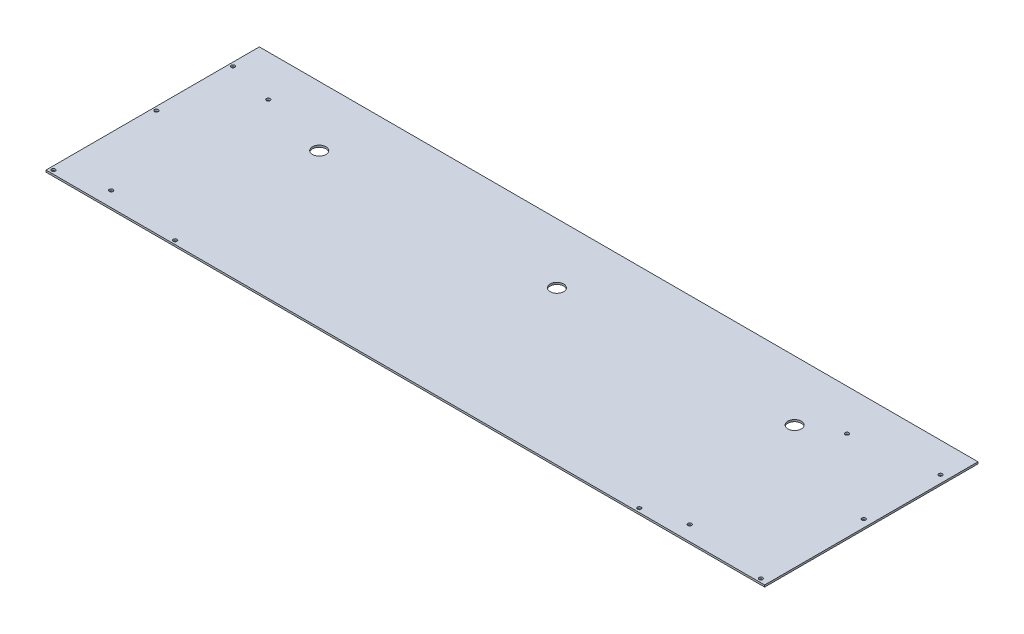
ISO-10303-21;
HEADER;
FILE_DESCRIPTION(('STEP AP214'),'2;1');
FILE_NAME('part.step','',(''),(''),'','','');
FILE_SCHEMA(('AUTOMOTIVE_DESIGN { 1 0 10303 214 1 1 1 1 }'));
ENDSEC;
DATA;
#1=APPLICATION_CONTEXT('core data for automotive mechanical design processes');
#2=APPLICATION_PROTOCOL_DEFINITION('international standard','automotive_design',2000,#1);
#3=PRODUCT_CONTEXT('',#1,'mechanical');
#4=PRODUCT('Part','Part','',(#3));
#5=PRODUCT_RELATED_PRODUCT_CATEGORY('part','',(#4));
#6=PRODUCT_DEFINITION_FORMATION('','',#4);
#7=PRODUCT_DEFINITION_CONTEXT('part definition',#1,'design');
#8=PRODUCT_DEFINITION('design','',#6,#7);
#9=PRODUCT_DEFINITION_SHAPE('','',#8);
#10=(LENGTH_UNIT() NAMED_UNIT(*) SI_UNIT(.MILLI.,.METRE.));
#11=(NAMED_UNIT(*) PLANE_ANGLE_UNIT() SI_UNIT($,.RADIAN.));
#12=(NAMED_UNIT(*) SI_UNIT($,.STERADIAN.) SOLID_ANGLE_UNIT());
#13=UNCERTAINTY_MEASURE_WITH_UNIT(LENGTH_MEASURE(1.E-05),#10,'distance_accuracy_value','');
#14=(GEOMETRIC_REPRESENTATION_CONTEXT(3) GLOBAL_UNCERTAINTY_ASSIGNED_CONTEXT((#13)) GLOBAL_UNIT_ASSIGNED_CONTEXT((#10,
#11,#12)) REPRESENTATION_CONTEXT('',''));
#15=CARTESIAN_POINT('',(0.,0.,0.));
#16=DIRECTION('',(0.,0.,1.));
#17=DIRECTION('',(1.,0.,0.));
#18=AXIS2_PLACEMENT_3D('',#15,#16,#17);
#19=CARTESIAN_POINT('',(1.58750000000008,-22.225,1612.9));
#20=DIRECTION('',(0.,-1.,0.));
#21=DIRECTION('',(0.,0.,-1.));
#22=AXIS2_PLACEMENT_3D('',#19,#20,#21);
#23=PLANE('',#22);
#24=CARTESIAN_POINT('',(600.075,-22.2249999999998,1482.78991037368));
#25=DIRECTION('',(0.,1.,0.));
#26=DIRECTION('',(0.,0.,1.));
#27=AXIS2_PLACEMENT_3D('',#24,#25,#26);
#28=CIRCLE('',#27,3.175);
#29=CARTESIAN_POINT('',(600.075,-22.2249999999998,1485.96491037368));
#30=VERTEX_POINT('',#29);
#31=EDGE_CURVE('E128',#30,#30,#28,.T.);
#32=ORIENTED_EDGE('',*,*,#31,.T.);
#33=EDGE_LOOP('',(#32));
#34=FACE_BOUND('',#33,.T.);
#35=CARTESIAN_POINT('',(393.7,-22.2249999999997,1787.525));
#36=DIRECTION('',(0.,1.,0.));
#37=DIRECTION('',(0.,0.,1.));
#38=AXIS2_PLACEMENT_3D('',#35,#36,#37);
#39=CIRCLE('',#38,3.175);
#40=CARTESIAN_POINT('',(393.7,-22.2249999999997,1790.7));
#41=VERTEX_POINT('',#40);
#42=EDGE_CURVE('E138',#41,#41,#39,.T.);
#43=ORIENTED_EDGE('',*,*,#42,.T.);
#44=EDGE_LOOP('',(#43));
#45=FACE_BOUND('',#44,.T.);
#46=CARTESIAN_POINT('',(-393.7,-22.225,1787.525));
#47=DIRECTION('',(0.,1.,0.));
#48=DIRECTION('',(0.,0.,1.));
#49=AXIS2_PLACEMENT_3D('',#46,#47,#48);
#50=CIRCLE('',#49,3.175);
#51=CARTESIAN_POINT('',(-393.7,-22.225,1790.7));
#52=VERTEX_POINT('',#51);
#53=EDGE_CURVE('E369',#52,#52,#50,.T.);
#54=ORIENTED_EDGE('',*,*,#53,.T.);
#55=EDGE_LOOP('',(#54));
#56=FACE_BOUND('',#55,.T.);
#57=CARTESIAN_POINT('',(403.225,-22.225,1533.525));
#58=DIRECTION('',(0.,1.,0.));
#59=DIRECTION('',(0.,0.,1.));
#60=AXIS2_PLACEMENT_3D('',#57,#58,#59);
#61=CIRCLE('',#60,11.43);
#62=CARTESIAN_POINT('',(403.225,-22.225,1544.955));
#63=VERTEX_POINT('',#62);
#64=EDGE_CURVE('E382',#63,#63,#61,.T.);
#65=ORIENTED_EDGE('',*,*,#64,.T.);
#66=EDGE_LOOP('',(#65));
#67=FACE_BOUND('',#66,.T.);
#68=DIRECTION('',(-1.,0.,0.));
#69=VECTOR('',#68,1.);
#70=CARTESIAN_POINT('',(1.58749999999981,-22.2249999999997,1793.875));
#71=LINE('',#70,#69);
#72=CARTESIAN_POINT('',(612.775,-22.2249999999999,1793.875));
#73=VERTEX_POINT('',#72);
#74=CARTESIAN_POINT('',(-606.425,-22.225,1793.875));
#75=VERTEX_POINT('',#74);
#76=EDGE_CURVE('E120',#73,#75,#71,.T.);
#77=ORIENTED_EDGE('',*,*,#76,.T.);
#78=DIRECTION('',(0.,0.,1.));
#79=VECTOR('',#78,1.);
#80=CARTESIAN_POINT('',(-606.425,-22.225,1613.48881511688));
#81=LINE('',#80,#79);
#82=CARTESIAN_POINT('',(-606.425,-22.225,1432.00160884857));
#83=VERTEX_POINT('',#82);
#84=EDGE_CURVE('E118',#83,#75,#81,.T.);
#85=ORIENTED_EDGE('',*,*,#84,.F.);
#86=DIRECTION('',(0.999998277526344,0.,-0.00185605612635899));
#87=VECTOR('',#86,1.);
#88=CARTESIAN_POINT('',(-585.7875,-22.225,1431.96330442429));
#89=LINE('',#88,#87);
#90=CARTESIAN_POINT('',(-565.149999998547,-22.225,1431.925));
#91=VERTEX_POINT('',#90);
#92=EDGE_CURVE('E69',#83,#91,#89,.T.);
#93=ORIENTED_EDGE('',*,*,#92,.T.);
#94=DIRECTION('',(1.,0.,0.));
#95=VECTOR('',#94,1.);
#96=CARTESIAN_POINT('',(0.,-22.225,1431.925));
#97=LINE('',#96,#95);
#98=CARTESIAN_POINT('',(612.775,-22.225,1431.925));
#99=VERTEX_POINT('',#98);
#100=EDGE_CURVE('E67',#99,#91,#97,.F.);
#101=ORIENTED_EDGE('',*,*,#100,.F.);
#102=DIRECTION('',(0.,0.,1.));
#103=VECTOR('',#102,1.);
#104=CARTESIAN_POINT('',(612.775,-22.225,1612.9));
#105=LINE('',#104,#103);
#106=EDGE_CURVE('E64',#99,#73,#105,.T.);
#107=ORIENTED_EDGE('',*,*,#106,.T.);
#108=EDGE_LOOP('',(#77,#85,#93,#101,#107));
#109=FACE_BOUND('',#108,.T.);
#110=CARTESIAN_POINT('',(-403.225,-22.225,1533.525));
#111=DIRECTION('',(0.,1.,0.));
#112=DIRECTION('',(0.,0.,1.));
#113=AXIS2_PLACEMENT_3D('',#110,#111,#112);
#114=CIRCLE('',#113,11.43);
#115=CARTESIAN_POINT('',(-403.225,-22.225,1544.955));
#116=VERTEX_POINT('',#115);
#117=EDGE_CURVE('E112',#116,#116,#114,.T.);
#118=ORIENTED_EDGE('',*,*,#117,.T.);
#119=EDGE_LOOP('',(#118));
#120=FACE_BOUND('',#119,.T.);
#121=CARTESIAN_POINT('',(0.,-22.225,1533.525));
#122=DIRECTION('',(0.,1.,0.));
#123=DIRECTION('',(0.,0.,1.));
#124=AXIS2_PLACEMENT_3D('',#121,#122,#123);
#125=CIRCLE('',#124,11.43);
#126=CARTESIAN_POINT('',(0.,-22.225,1544.955));
#127=VERTEX_POINT('',#126);
#128=EDGE_CURVE('E387',#127,#127,#125,.T.);
#129=ORIENTED_EDGE('',*,*,#128,.T.);
#130=EDGE_LOOP('',(#129));
#131=FACE_BOUND('',#130,.T.);
#132=CARTESIAN_POINT('',(-600.075,-22.225,1787.525));
#133=DIRECTION('',(0.,1.,0.));
#134=DIRECTION('',(0.,0.,1.));
#135=AXIS2_PLACEMENT_3D('',#132,#133,#134);
#136=CIRCLE('',#135,3.175);
#137=CARTESIAN_POINT('',(-600.075,-22.225,1790.7));
#138=VERTEX_POINT('',#137);
#139=EDGE_CURVE('E75',#138,#138,#136,.T.);
#140=ORIENTED_EDGE('',*,*,#139,.T.);
#141=EDGE_LOOP('',(#140));
#142=FACE_BOUND('',#141,.T.);
#143=CARTESIAN_POINT('',(600.075,-22.2249999999998,1612.93830442429));
#144=DIRECTION('',(0.,1.,0.));
#145=DIRECTION('',(0.,0.,1.));
#146=AXIS2_PLACEMENT_3D('',#143,#144,#145);
#147=CIRCLE('',#146,3.175);
#148=CARTESIAN_POINT('',(600.075,-22.2249999999998,1616.11330442429));
#149=VERTEX_POINT('',#148);
#150=EDGE_CURVE('E386',#149,#149,#147,.T.);
#151=ORIENTED_EDGE('',*,*,#150,.T.);
#152=EDGE_LOOP('',(#151));
#153=FACE_BOUND('',#152,.T.);
#154=CARTESIAN_POINT('',(-600.075,-22.225,1482.78991037368));
#155=DIRECTION('',(0.,1.,0.));
#156=DIRECTION('',(0.,0.,1.));
#157=AXIS2_PLACEMENT_3D('',#154,#155,#156);
#158=CIRCLE('',#157,3.175);
#159=CARTESIAN_POINT('',(-600.075,-22.225,1485.96491037368));
#160=VERTEX_POINT('',#159);
#161=EDGE_CURVE('E153',#160,#160,#158,.T.);
#162=ORIENTED_EDGE('',*,*,#161,.T.);
#163=EDGE_LOOP('',(#162));
#164=FACE_BOUND('',#163,.T.);
#165=CARTESIAN_POINT('',(600.075,-22.2249999999997,1787.525));
#166=DIRECTION('',(0.,1.,0.));
#167=DIRECTION('',(0.,0.,1.));
#168=AXIS2_PLACEMENT_3D('',#165,#166,#167);
#169=CIRCLE('',#168,3.175);
#170=CARTESIAN_POINT('',(600.075,-22.2249999999997,1790.7));
#171=VERTEX_POINT('',#170);
#172=EDGE_CURVE('E133',#171,#171,#169,.T.);
#173=ORIENTED_EDGE('',*,*,#172,.T.);
#174=EDGE_LOOP('',(#173));
#175=FACE_BOUND('',#174,.T.);
#176=CARTESIAN_POINT('',(-600.075,-22.225,1612.93830442429));
#177=DIRECTION('',(0.,1.,0.));
#178=DIRECTION('',(0.,0.,1.));
#179=AXIS2_PLACEMENT_3D('',#176,#177,#178);
#180=CIRCLE('',#179,3.175);
#181=CARTESIAN_POINT('',(-600.075,-22.225,1616.11330442429));
#182=VERTEX_POINT('',#181);
#183=EDGE_CURVE('E150',#182,#182,#180,.T.);
#184=ORIENTED_EDGE('',*,*,#183,.T.);
#185=EDGE_LOOP('',(#184));
#186=FACE_BOUND('',#185,.T.);
#187=CARTESIAN_POINT('',(-521.299365329742,-22.225,1501.775));
#188=DIRECTION('',(0.,1.,0.));
#189=DIRECTION('',(0.,0.,1.));
#190=AXIS2_PLACEMENT_3D('',#187,#188,#189);
#191=CIRCLE('',#190,3.175);
#192=CARTESIAN_POINT('',(-521.299365329742,-22.225,1504.95));
#193=VERTEX_POINT('',#192);
#194=EDGE_CURVE('E154',#193,#193,#191,.T.);
#195=ORIENTED_EDGE('',*,*,#194,.T.);
#196=EDGE_LOOP('',(#195));
#197=FACE_BOUND('',#196,.T.);
#198=CARTESIAN_POINT('',(460.375,-22.2249999999997,1768.475));
#199=DIRECTION('',(0.,1.,0.));
#200=DIRECTION('',(0.,0.,1.));
#201=AXIS2_PLACEMENT_3D('',#198,#199,#200);
#202=CIRCLE('',#201,3.175);
#203=CARTESIAN_POINT('',(460.375,-22.2249999999997,1771.65));
#204=VERTEX_POINT('',#203);
#205=EDGE_CURVE('E160',#204,#204,#202,.T.);
#206=ORIENTED_EDGE('',*,*,#205,.T.);
#207=EDGE_LOOP('',(#206));
#208=FACE_BOUND('',#207,.T.);
#209=CARTESIAN_POINT('',(-521.299365329743,-22.225,1768.475));
#210=DIRECTION('',(0.,1.,0.));
#211=DIRECTION('',(0.,0.,1.));
#212=AXIS2_PLACEMENT_3D('',#209,#210,#211);
#213=CIRCLE('',#212,3.175);
#214=CARTESIAN_POINT('',(-521.299365329743,-22.225,1771.65));
#215=VERTEX_POINT('',#214);
#216=EDGE_CURVE('E163',#215,#215,#213,.T.);
#217=ORIENTED_EDGE('',*,*,#216,.T.);
#218=EDGE_LOOP('',(#217));
#219=FACE_BOUND('',#218,.T.);
#220=CARTESIAN_POINT('',(460.375,-22.225,1501.775));
#221=DIRECTION('',(0.,1.,0.));
#222=DIRECTION('',(0.,0.,1.));
#223=AXIS2_PLACEMENT_3D('',#220,#221,#222);
#224=CIRCLE('',#223,3.175);
#225=CARTESIAN_POINT('',(460.375,-22.225,1504.95));
#226=VERTEX_POINT('',#225);
#227=EDGE_CURVE('E20',#226,#226,#224,.T.);
#228=ORIENTED_EDGE('',*,*,#227,.T.);
#229=EDGE_LOOP('',(#228));
#230=FACE_BOUND('',#229,.T.);
#231=ADVANCED_FACE('F17',(#34,#45,#56,#67,#109,#120,#131,#142,#153,#164,#175,#186,#197,#208,
#219,#230),#23,.T.);
#232=CARTESIAN_POINT('',(460.375,3.17500000000021,1501.775));
#233=DIRECTION('',(0.,1.,0.));
#234=DIRECTION('',(0.,0.,1.));
#235=AXIS2_PLACEMENT_3D('',#232,#233,#234);
#236=CYLINDRICAL_SURFACE('',#235,3.175);
#237=CARTESIAN_POINT('',(460.375,-19.05,1501.775));
#238=DIRECTION('',(0.,1.,0.));
#239=DIRECTION('',(0.,0.,1.));
#240=AXIS2_PLACEMENT_3D('',#237,#238,#239);
#241=CIRCLE('',#240,3.175);
#242=CARTESIAN_POINT('',(460.375,-19.05,1504.95));
#243=VERTEX_POINT('',#242);
#244=EDGE_CURVE('E132',#243,#243,#241,.T.);
#245=ORIENTED_EDGE('',*,*,#244,.T.);
#246=EDGE_LOOP('',(#245));
#247=FACE_BOUND('',#246,.T.);
#248=ORIENTED_EDGE('',*,*,#227,.F.);
#249=EDGE_LOOP('',(#248));
#250=FACE_BOUND('',#249,.T.);
#251=ADVANCED_FACE('F173',(#247,#250),#236,.F.);
#252=CARTESIAN_POINT('',(-521.299365329743,3.17500000000011,1768.475));
#253=DIRECTION('',(0.,1.,0.));
#254=DIRECTION('',(0.,0.,1.));
#255=AXIS2_PLACEMENT_3D('',#252,#253,#254);
#256=CYLINDRICAL_SURFACE('',#255,3.175);
#257=CARTESIAN_POINT('',(-521.299365329743,-19.05,1768.475));
#258=DIRECTION('',(0.,1.,0.));
#259=DIRECTION('',(0.,0.,1.));
#260=AXIS2_PLACEMENT_3D('',#257,#258,#259);
#261=CIRCLE('',#260,3.175);
#262=CARTESIAN_POINT('',(-521.299365329743,-19.05,1771.65));
#263=VERTEX_POINT('',#262);
#264=EDGE_CURVE('E271',#263,#263,#261,.T.);
#265=ORIENTED_EDGE('',*,*,#264,.T.);
#266=EDGE_LOOP('',(#265));
#267=FACE_BOUND('',#266,.T.);
#268=ORIENTED_EDGE('',*,*,#216,.F.);
#269=EDGE_LOOP('',(#268));
#270=FACE_BOUND('',#269,.T.);
#271=ADVANCED_FACE('F175',(#267,#270),#256,.F.);
#272=CARTESIAN_POINT('',(460.375,3.17500000000029,1768.475));
#273=DIRECTION('',(0.,1.,0.));
#274=DIRECTION('',(0.,0.,1.));
#275=AXIS2_PLACEMENT_3D('',#272,#273,#274);
#276=CYLINDRICAL_SURFACE('',#275,3.175);
#277=CARTESIAN_POINT('',(460.375,-19.0499999999997,1768.475));
#278=DIRECTION('',(0.,1.,0.));
#279=DIRECTION('',(0.,0.,1.));
#280=AXIS2_PLACEMENT_3D('',#277,#278,#279);
#281=CIRCLE('',#280,3.175);
#282=CARTESIAN_POINT('',(460.375,-19.0499999999997,1771.65));
#283=VERTEX_POINT('',#282);
#284=EDGE_CURVE('E266',#283,#283,#281,.T.);
#285=ORIENTED_EDGE('',*,*,#284,.T.);
#286=EDGE_LOOP('',(#285));
#287=FACE_BOUND('',#286,.T.);
#288=ORIENTED_EDGE('',*,*,#205,.F.);
#289=EDGE_LOOP('',(#288));
#290=FACE_BOUND('',#289,.T.);
#291=ADVANCED_FACE('F182',(#287,#290),#276,.F.);
#292=CARTESIAN_POINT('',(-521.299365329742,3.175,1501.775));
#293=DIRECTION('',(0.,1.,0.));
#294=DIRECTION('',(0.,0.,1.));
#295=AXIS2_PLACEMENT_3D('',#292,#293,#294);
#296=CYLINDRICAL_SURFACE('',#295,3.175);
#297=CARTESIAN_POINT('',(-521.299365329742,-19.05,1501.775));
#298=DIRECTION('',(0.,1.,0.));
#299=DIRECTION('',(0.,0.,1.));
#300=AXIS2_PLACEMENT_3D('',#297,#298,#299);
#301=CIRCLE('',#300,3.175);
#302=CARTESIAN_POINT('',(-521.299365329742,-19.05,1504.95));
#303=VERTEX_POINT('',#302);
#304=EDGE_CURVE('E270',#303,#303,#301,.T.);
#305=ORIENTED_EDGE('',*,*,#304,.T.);
#306=EDGE_LOOP('',(#305));
#307=FACE_BOUND('',#306,.T.);
#308=ORIENTED_EDGE('',*,*,#194,.F.);
#309=EDGE_LOOP('',(#308));
#310=FACE_BOUND('',#309,.T.);
#311=ADVANCED_FACE('F254',(#307,#310),#296,.F.);
#312=CARTESIAN_POINT('',(-600.075,-15.875,1612.93830442429));
#313=DIRECTION('',(0.,1.,0.));
#314=DIRECTION('',(0.,0.,1.));
#315=AXIS2_PLACEMENT_3D('',#312,#313,#314);
#316=CYLINDRICAL_SURFACE('',#315,3.175);
#317=CARTESIAN_POINT('',(-600.075,-19.05,1612.93830442429));
#318=DIRECTION('',(0.,1.,0.));
#319=DIRECTION('',(0.,0.,1.));
#320=AXIS2_PLACEMENT_3D('',#317,#318,#319);
#321=CIRCLE('',#320,3.175);
#322=CARTESIAN_POINT('',(-600.075,-19.05,1616.11330442429));
#323=VERTEX_POINT('',#322);
#324=EDGE_CURVE('E274',#323,#323,#321,.T.);
#325=ORIENTED_EDGE('',*,*,#324,.T.);
#326=EDGE_LOOP('',(#325));
#327=FACE_BOUND('',#326,.T.);
#328=ORIENTED_EDGE('',*,*,#183,.F.);
#329=EDGE_LOOP('',(#328));
#330=FACE_BOUND('',#329,.T.);
#331=ADVANCED_FACE('F250',(#327,#330),#316,.F.);
#332=CARTESIAN_POINT('',(-600.075,-15.875,1482.78991037368));
#333=DIRECTION('',(0.,1.,0.));
#334=DIRECTION('',(0.,0.,1.));
#335=AXIS2_PLACEMENT_3D('',#332,#333,#334);
#336=CYLINDRICAL_SURFACE('',#335,3.175);
#337=CARTESIAN_POINT('',(-600.075,-19.05,1482.78991037368));
#338=DIRECTION('',(0.,1.,0.));
#339=DIRECTION('',(0.,0.,1.));
#340=AXIS2_PLACEMENT_3D('',#337,#338,#339);
#341=CIRCLE('',#340,3.175);
#342=CARTESIAN_POINT('',(-600.075,-19.05,1485.96491037368));
#343=VERTEX_POINT('',#342);
#344=EDGE_CURVE('E289',#343,#343,#341,.T.);
#345=ORIENTED_EDGE('',*,*,#344,.T.);
#346=EDGE_LOOP('',(#345));
#347=FACE_BOUND('',#346,.T.);
#348=ORIENTED_EDGE('',*,*,#161,.F.);
#349=EDGE_LOOP('',(#348));
#350=FACE_BOUND('',#349,.T.);
#351=ADVANCED_FACE('F246',(#347,#350),#336,.F.);
#352=CARTESIAN_POINT('',(-393.7,-15.875,1787.525));
#353=DIRECTION('',(0.,1.,0.));
#354=DIRECTION('',(0.,0.,1.));
#355=AXIS2_PLACEMENT_3D('',#352,#353,#354);
#356=CYLINDRICAL_SURFACE('',#355,3.175);
#357=CARTESIAN_POINT('',(-393.7,-19.05,1787.525));
#358=DIRECTION('',(0.,1.,0.));
#359=DIRECTION('',(0.,0.,1.));
#360=AXIS2_PLACEMENT_3D('',#357,#358,#359);
#361=CIRCLE('',#360,3.175);
#362=CARTESIAN_POINT('',(-393.7,-19.05,1790.7));
#363=VERTEX_POINT('',#362);
#364=EDGE_CURVE('E293',#363,#363,#361,.T.);
#365=ORIENTED_EDGE('',*,*,#364,.T.);
#366=EDGE_LOOP('',(#365));
#367=FACE_BOUND('',#366,.T.);
#368=ORIENTED_EDGE('',*,*,#53,.F.);
#369=EDGE_LOOP('',(#368));
#370=FACE_BOUND('',#369,.T.);
#371=ADVANCED_FACE('F242',(#367,#370),#356,.F.);
#372=CARTESIAN_POINT('',(-600.075,-15.875,1787.525));
#373=DIRECTION('',(0.,1.,0.));
#374=DIRECTION('',(0.,0.,1.));
#375=AXIS2_PLACEMENT_3D('',#372,#373,#374);
#376=CYLINDRICAL_SURFACE('',#375,3.175);
#377=CARTESIAN_POINT('',(-600.075,-19.05,1787.525));
#378=DIRECTION('',(0.,1.,0.));
#379=DIRECTION('',(0.,0.,1.));
#380=AXIS2_PLACEMENT_3D('',#377,#378,#379);
#381=CIRCLE('',#380,3.175);
#382=CARTESIAN_POINT('',(-600.075,-19.05,1790.7));
#383=VERTEX_POINT('',#382);
#384=EDGE_CURVE('E110',#383,#383,#381,.T.);
#385=ORIENTED_EDGE('',*,*,#384,.T.);
#386=EDGE_LOOP('',(#385));
#387=FACE_BOUND('',#386,.T.);
#388=ORIENTED_EDGE('',*,*,#139,.F.);
#389=EDGE_LOOP('',(#388));
#390=FACE_BOUND('',#389,.T.);
#391=ADVANCED_FACE('F239',(#387,#390),#376,.F.);
#392=CARTESIAN_POINT('',(0.,-19.05,1431.925));
#393=DIRECTION('',(0.,0.,-1.));
#394=DIRECTION('',(0.,1.,0.));
#395=AXIS2_PLACEMENT_3D('',#392,#393,#394);
#396=PLANE('',#395);
#397=DIRECTION('',(1.,0.,0.));
#398=VECTOR('',#397,1.);
#399=CARTESIAN_POINT('',(1.58750000000008,-19.0500000000001,1431.925));
#400=LINE('',#399,#398);
#401=CARTESIAN_POINT('',(-565.149999989423,-19.05,1431.92499999999));
#402=VERTEX_POINT('',#401);
#403=CARTESIAN_POINT('',(612.775,-19.0499999999999,1431.925));
#404=VERTEX_POINT('',#403);
#405=EDGE_CURVE('E86',#402,#404,#400,.T.);
#406=ORIENTED_EDGE('',*,*,#405,.T.);
#407=DIRECTION('',(0.,-1.,0.));
#408=VECTOR('',#407,1.);
#409=CARTESIAN_POINT('',(612.775,-19.0499999999998,1431.925));
#410=LINE('',#409,#408);
#411=EDGE_CURVE('E74',#404,#99,#410,.T.);
#412=ORIENTED_EDGE('',*,*,#411,.T.);
#413=ORIENTED_EDGE('',*,*,#100,.T.);
#414=DIRECTION('',(0.,1.,0.));
#415=VECTOR('',#414,1.);
#416=CARTESIAN_POINT('',(-565.15,-19.05,1431.925));
#417=LINE('',#416,#415);
#418=EDGE_CURVE('E114',#91,#402,#417,.T.);
#419=ORIENTED_EDGE('',*,*,#418,.T.);
#420=EDGE_LOOP('',(#406,#412,#413,#419));
#421=FACE_BOUND('',#420,.T.);
#422=ADVANCED_FACE('F85',(#421),#396,.T.);
#423=CARTESIAN_POINT('',(612.775,-19.0499999999998,1612.9));
#424=DIRECTION('',(-1.,0.,0.));
#425=DIRECTION('',(0.,-1.,0.));
#426=AXIS2_PLACEMENT_3D('',#423,#424,#425);
#427=PLANE('',#426);
#428=ORIENTED_EDGE('',*,*,#411,.F.);
#429=DIRECTION('',(0.,0.,-1.));
#430=VECTOR('',#429,1.);
#431=CARTESIAN_POINT('',(612.775,-19.0499999999999,1612.9));
#432=LINE('',#431,#430);
#433=CARTESIAN_POINT('',(612.775,-19.0499999999998,1793.875));
#434=VERTEX_POINT('',#433);
#435=EDGE_CURVE('E107',#404,#434,#432,.F.);
#436=ORIENTED_EDGE('',*,*,#435,.T.);
#437=DIRECTION('',(0.,1.,0.));
#438=VECTOR('',#437,1.);
#439=CARTESIAN_POINT('',(612.775,-19.05,1793.875));
#440=LINE('',#439,#438);
#441=EDGE_CURVE('E82',#434,#73,#440,.F.);
#442=ORIENTED_EDGE('',*,*,#441,.T.);
#443=ORIENTED_EDGE('',*,*,#106,.F.);
#444=EDGE_LOOP('',(#428,#436,#442,#443));
#445=FACE_BOUND('',#444,.T.);
#446=ADVANCED_FACE('F79',(#445),#427,.F.);
#447=CARTESIAN_POINT('',(1.58749999999981,-19.05,1793.875));
#448=DIRECTION('',(0.,0.,-1.));
#449=DIRECTION('',(-1.,0.,0.));
#450=AXIS2_PLACEMENT_3D('',#447,#448,#449);
#451=PLANE('',#450);
#452=ORIENTED_EDGE('',*,*,#441,.F.);
#453=DIRECTION('',(1.,0.,0.));
#454=VECTOR('',#453,1.);
#455=CARTESIAN_POINT('',(1.58750000000008,-19.0499999999999,1793.875));
#456=LINE('',#455,#454);
#457=CARTESIAN_POINT('',(-606.425,-19.05,1793.875));
#458=VERTEX_POINT('',#457);
#459=EDGE_CURVE('E104',#434,#458,#456,.F.);
#460=ORIENTED_EDGE('',*,*,#459,.T.);
#461=DIRECTION('',(0.,-1.,0.));
#462=VECTOR('',#461,1.);
#463=CARTESIAN_POINT('',(-606.425,-19.05,1793.875));
#464=LINE('',#463,#462);
#465=EDGE_CURVE('E116',#75,#458,#464,.F.);
#466=ORIENTED_EDGE('',*,*,#465,.F.);
#467=ORIENTED_EDGE('',*,*,#76,.F.);
#468=EDGE_LOOP('',(#452,#460,#466,#467));
#469=FACE_BOUND('',#468,.T.);
#470=ADVANCED_FACE('F230',(#469),#451,.F.);
#471=CARTESIAN_POINT('',(-606.425,-19.05,1613.48881511688));
#472=DIRECTION('',(-1.,0.,0.));
#473=DIRECTION('',(0.,-1.,0.));
#474=AXIS2_PLACEMENT_3D('',#471,#472,#473);
#475=PLANE('',#474);
#476=DIRECTION('',(0.,0.,-1.));
#477=VECTOR('',#476,1.);
#478=CARTESIAN_POINT('',(-606.425,-19.0500000000001,1612.9));
#479=LINE('',#478,#477);
#480=CARTESIAN_POINT('',(-606.425,-19.05,1432.00160884857));
#481=VERTEX_POINT('',#480);
#482=EDGE_CURVE('E98',#458,#481,#479,.T.);
#483=ORIENTED_EDGE('',*,*,#482,.T.);
#484=DIRECTION('',(0.,1.,0.));
#485=VECTOR('',#484,1.);
#486=CARTESIAN_POINT('',(-606.425,-19.05,1432.00160884858));
#487=LINE('',#486,#485);
#488=EDGE_CURVE('E36',#481,#83,#487,.F.);
#489=ORIENTED_EDGE('',*,*,#488,.T.);
#490=ORIENTED_EDGE('',*,*,#84,.T.);
#491=ORIENTED_EDGE('',*,*,#465,.T.);
#492=EDGE_LOOP('',(#483,#489,#490,#491));
#493=FACE_BOUND('',#492,.T.);
#494=ADVANCED_FACE('F227',(#493),#475,.T.);
#495=CARTESIAN_POINT('',(-585.7875,-19.05,1431.96330442429));
#496=DIRECTION('',(0.00185605612635899,0.,0.999998277526344));
#497=DIRECTION('',(0.999998277526344,0.,-0.00185605612635899));
#498=AXIS2_PLACEMENT_3D('',#495,#496,#497);
#499=PLANE('',#498);
#500=ORIENTED_EDGE('',*,*,#488,.F.);
#501=DIRECTION('',(0.999998277526345,0.,-0.00185605612631057));
#502=VECTOR('',#501,1.);
#503=CARTESIAN_POINT('',(-606.425,-19.0500000000002,1432.00160884857));
#504=LINE('',#503,#502);
#505=EDGE_CURVE('E103',#481,#402,#504,.T.);
#506=ORIENTED_EDGE('',*,*,#505,.T.);
#507=ORIENTED_EDGE('',*,*,#418,.F.);
#508=ORIENTED_EDGE('',*,*,#92,.F.);
#509=EDGE_LOOP('',(#500,#506,#507,#508));
#510=FACE_BOUND('',#509,.T.);
#511=ADVANCED_FACE('F223',(#510),#499,.F.);
#512=CARTESIAN_POINT('',(-403.225,3.17500000000006,1533.525));
#513=DIRECTION('',(0.,1.,0.));
#514=DIRECTION('',(0.,0.,1.));
#515=AXIS2_PLACEMENT_3D('',#512,#513,#514);
#516=CYLINDRICAL_SURFACE('',#515,11.43);
#517=CARTESIAN_POINT('',(-403.225,-19.05,1533.525));
#518=DIRECTION('',(0.,1.,0.));
#519=DIRECTION('',(0.,0.,1.));
#520=AXIS2_PLACEMENT_3D('',#517,#518,#519);
#521=CIRCLE('',#520,11.43);
#522=CARTESIAN_POINT('',(-403.225,-19.05,1544.955));
#523=VERTEX_POINT('',#522);
#524=EDGE_CURVE('E304',#523,#523,#521,.T.);
#525=ORIENTED_EDGE('',*,*,#524,.T.);
#526=EDGE_LOOP('',(#525));
#527=FACE_BOUND('',#526,.T.);
#528=ORIENTED_EDGE('',*,*,#117,.F.);
#529=EDGE_LOOP('',(#528));
#530=FACE_BOUND('',#529,.T.);
#531=ADVANCED_FACE('F219',(#527,#530),#516,.F.);
#532=CARTESIAN_POINT('',(0.,3.17500000000013,1533.525));
#533=DIRECTION('',(0.,1.,0.));
#534=DIRECTION('',(0.,0.,1.));
#535=AXIS2_PLACEMENT_3D('',#532,#533,#534);
#536=CYLINDRICAL_SURFACE('',#535,11.43);
#537=CARTESIAN_POINT('',(0.,-19.05,1533.525));
#538=DIRECTION('',(0.,1.,0.));
#539=DIRECTION('',(0.,0.,1.));
#540=AXIS2_PLACEMENT_3D('',#537,#538,#539);
#541=CIRCLE('',#540,11.43);
#542=CARTESIAN_POINT('',(0.,-19.05,1544.955));
#543=VERTEX_POINT('',#542);
#544=EDGE_CURVE('E307',#543,#543,#541,.T.);
#545=ORIENTED_EDGE('',*,*,#544,.T.);
#546=EDGE_LOOP('',(#545));
#547=FACE_BOUND('',#546,.T.);
#548=ORIENTED_EDGE('',*,*,#128,.F.);
#549=EDGE_LOOP('',(#548));
#550=FACE_BOUND('',#549,.T.);
#551=ADVANCED_FACE('F215',(#547,#550),#536,.F.);
#552=CARTESIAN_POINT('',(403.225,3.17500000000021,1533.525));
#553=DIRECTION('',(0.,1.,0.));
#554=DIRECTION('',(0.,0.,1.));
#555=AXIS2_PLACEMENT_3D('',#552,#553,#554);
#556=CYLINDRICAL_SURFACE('',#555,11.43);
#557=CARTESIAN_POINT('',(403.225,-19.05,1533.525));
#558=DIRECTION('',(0.,1.,0.));
#559=DIRECTION('',(0.,0.,1.));
#560=AXIS2_PLACEMENT_3D('',#557,#558,#559);
#561=CIRCLE('',#560,11.43);
#562=CARTESIAN_POINT('',(403.225,-19.05,1544.955));
#563=VERTEX_POINT('',#562);
#564=EDGE_CURVE('E311',#563,#563,#561,.T.);
#565=ORIENTED_EDGE('',*,*,#564,.T.);
#566=EDGE_LOOP('',(#565));
#567=FACE_BOUND('',#566,.T.);
#568=ORIENTED_EDGE('',*,*,#64,.F.);
#569=EDGE_LOOP('',(#568));
#570=FACE_BOUND('',#569,.T.);
#571=ADVANCED_FACE('F211',(#567,#570),#556,.F.);
#572=CARTESIAN_POINT('',(600.075,-15.8749999999998,1612.93830442429));
#573=DIRECTION('',(0.,1.,0.));
#574=DIRECTION('',(0.,0.,1.));
#575=AXIS2_PLACEMENT_3D('',#572,#573,#574);
#576=CYLINDRICAL_SURFACE('',#575,3.175);
#577=CARTESIAN_POINT('',(600.075,-19.0499999999998,1612.93830442429));
#578=DIRECTION('',(0.,1.,0.));
#579=DIRECTION('',(0.,0.,1.));
#580=AXIS2_PLACEMENT_3D('',#577,#578,#579);
#581=CIRCLE('',#580,3.175);
#582=CARTESIAN_POINT('',(600.075,-19.0499999999998,1616.11330442429));
#583=VERTEX_POINT('',#582);
#584=EDGE_CURVE('E315',#583,#583,#581,.T.);
#585=ORIENTED_EDGE('',*,*,#584,.T.);
#586=EDGE_LOOP('',(#585));
#587=FACE_BOUND('',#586,.T.);
#588=ORIENTED_EDGE('',*,*,#150,.F.);
#589=EDGE_LOOP('',(#588));
#590=FACE_BOUND('',#589,.T.);
#591=ADVANCED_FACE('F207',(#587,#590),#576,.F.);
#592=CARTESIAN_POINT('',(393.7,-15.8749999999997,1787.525));
#593=DIRECTION('',(0.,1.,0.));
#594=DIRECTION('',(0.,0.,1.));
#595=AXIS2_PLACEMENT_3D('',#592,#593,#594);
#596=CYLINDRICAL_SURFACE('',#595,3.175);
#597=CARTESIAN_POINT('',(393.7,-19.0499999999997,1787.525));
#598=DIRECTION('',(0.,1.,0.));
#599=DIRECTION('',(0.,0.,1.));
#600=AXIS2_PLACEMENT_3D('',#597,#598,#599);
#601=CIRCLE('',#600,3.175);
#602=CARTESIAN_POINT('',(393.7,-19.0499999999997,1790.7));
#603=VERTEX_POINT('',#602);
#604=EDGE_CURVE('E321',#603,#603,#601,.T.);
#605=ORIENTED_EDGE('',*,*,#604,.T.);
#606=EDGE_LOOP('',(#605));
#607=FACE_BOUND('',#606,.T.);
#608=ORIENTED_EDGE('',*,*,#42,.F.);
#609=EDGE_LOOP('',(#608));
#610=FACE_BOUND('',#609,.T.);
#611=ADVANCED_FACE('F203',(#607,#610),#596,.F.);
#612=CARTESIAN_POINT('',(600.075,-15.8749999999997,1787.525));
#613=DIRECTION('',(0.,1.,0.));
#614=DIRECTION('',(0.,0.,1.));
#615=AXIS2_PLACEMENT_3D('',#612,#613,#614);
#616=CYLINDRICAL_SURFACE('',#615,3.175);
#617=CARTESIAN_POINT('',(600.075,-19.0499999999997,1787.525));
#618=DIRECTION('',(0.,1.,0.));
#619=DIRECTION('',(0.,0.,1.));
#620=AXIS2_PLACEMENT_3D('',#617,#618,#619);
#621=CIRCLE('',#620,3.175);
#622=CARTESIAN_POINT('',(600.075,-19.0499999999997,1790.7));
#623=VERTEX_POINT('',#622);
#624=EDGE_CURVE('E27',#623,#623,#621,.T.);
#625=ORIENTED_EDGE('',*,*,#624,.T.);
#626=EDGE_LOOP('',(#625));
#627=FACE_BOUND('',#626,.T.);
#628=ORIENTED_EDGE('',*,*,#172,.F.);
#629=EDGE_LOOP('',(#628));
#630=FACE_BOUND('',#629,.T.);
#631=ADVANCED_FACE('F195',(#627,#630),#616,.F.);
#632=CARTESIAN_POINT('',(600.075,-15.8749999999998,1482.78991037368));
#633=DIRECTION('',(0.,1.,0.));
#634=DIRECTION('',(0.,0.,1.));
#635=AXIS2_PLACEMENT_3D('',#632,#633,#634);
#636=CYLINDRICAL_SURFACE('',#635,3.175);
#637=CARTESIAN_POINT('',(600.075,-19.0499999999998,1482.78991037368));
#638=DIRECTION('',(0.,1.,0.));
#639=DIRECTION('',(0.,0.,1.));
#640=AXIS2_PLACEMENT_3D('',#637,#638,#639);
#641=CIRCLE('',#640,3.175);
#642=CARTESIAN_POINT('',(600.075,-19.0499999999998,1485.96491037368));
#643=VERTEX_POINT('',#642);
#644=EDGE_CURVE('E10',#643,#643,#641,.T.);
#645=ORIENTED_EDGE('',*,*,#644,.T.);
#646=EDGE_LOOP('',(#645));
#647=FACE_BOUND('',#646,.T.);
#648=ORIENTED_EDGE('',*,*,#31,.F.);
#649=EDGE_LOOP('',(#648));
#650=FACE_BOUND('',#649,.T.);
#651=ADVANCED_FACE('F189',(#647,#650),#636,.F.);
#652=CARTESIAN_POINT('',(1.58750000000008,-19.05,1612.9));
#653=DIRECTION('',(0.,-1.,0.));
#654=DIRECTION('',(0.,0.,-1.));
#655=AXIS2_PLACEMENT_3D('',#652,#653,#654);
#656=PLANE('',#655);
#657=ORIENTED_EDGE('',*,*,#644,.F.);
#658=EDGE_LOOP('',(#657));
#659=FACE_BOUND('',#658,.T.);
#660=ORIENTED_EDGE('',*,*,#624,.F.);
#661=EDGE_LOOP('',(#660));
#662=FACE_BOUND('',#661,.T.);
#663=ORIENTED_EDGE('',*,*,#604,.F.);
#664=EDGE_LOOP('',(#663));
#665=FACE_BOUND('',#664,.T.);
#666=ORIENTED_EDGE('',*,*,#584,.F.);
#667=EDGE_LOOP('',(#666));
#668=FACE_BOUND('',#667,.T.);
#669=ORIENTED_EDGE('',*,*,#564,.F.);
#670=EDGE_LOOP('',(#669));
#671=FACE_BOUND('',#670,.T.);
#672=ORIENTED_EDGE('',*,*,#544,.F.);
#673=EDGE_LOOP('',(#672));
#674=FACE_BOUND('',#673,.T.);
#675=ORIENTED_EDGE('',*,*,#524,.F.);
#676=EDGE_LOOP('',(#675));
#677=FACE_BOUND('',#676,.T.);
#678=ORIENTED_EDGE('',*,*,#482,.F.);
#679=ORIENTED_EDGE('',*,*,#459,.F.);
#680=ORIENTED_EDGE('',*,*,#435,.F.);
#681=ORIENTED_EDGE('',*,*,#405,.F.);
#682=ORIENTED_EDGE('',*,*,#505,.F.);
#683=EDGE_LOOP('',(#678,#679,#680,#681,#682));
#684=FACE_BOUND('',#683,.T.);
#685=ORIENTED_EDGE('',*,*,#384,.F.);
#686=EDGE_LOOP('',(#685));
#687=FACE_BOUND('',#686,.T.);
#688=ORIENTED_EDGE('',*,*,#364,.F.);
#689=EDGE_LOOP('',(#688));
#690=FACE_BOUND('',#689,.T.);
#691=ORIENTED_EDGE('',*,*,#344,.F.);
#692=EDGE_LOOP('',(#691));
#693=FACE_BOUND('',#692,.T.);
#694=ORIENTED_EDGE('',*,*,#324,.F.);
#695=EDGE_LOOP('',(#694));
#696=FACE_BOUND('',#695,.T.);
#697=ORIENTED_EDGE('',*,*,#304,.F.);
#698=EDGE_LOOP('',(#697));
#699=FACE_BOUND('',#698,.T.);
#700=ORIENTED_EDGE('',*,*,#284,.F.);
#701=EDGE_LOOP('',(#700));
#702=FACE_BOUND('',#701,.T.);
#703=ORIENTED_EDGE('',*,*,#264,.F.);
#704=EDGE_LOOP('',(#703));
#705=FACE_BOUND('',#704,.T.);
#706=ORIENTED_EDGE('',*,*,#244,.F.);
#707=EDGE_LOOP('',(#706));
#708=FACE_BOUND('',#707,.T.);
#709=ADVANCED_FACE('F187',(#659,#662,#665,#668,#671,#674,#677,#684,#687,#690,#693,#696,#699,
#702,#705,#708),#656,.F.);
#710=CLOSED_SHELL('',(#231,#251,#271,#291,#311,#331,#351,#371,#391,#422,#446,#470,#494,#511,
#531,#551,#571,#591,#611,#631,#651,#709));
#711=MANIFOLD_SOLID_BREP('B1',#710);
#712=ADVANCED_BREP_SHAPE_REPRESENTATION('',(#18,#711),#14);
#713=SHAPE_DEFINITION_REPRESENTATION(#9,#712);
ENDSEC;
END-ISO-10303-21;
